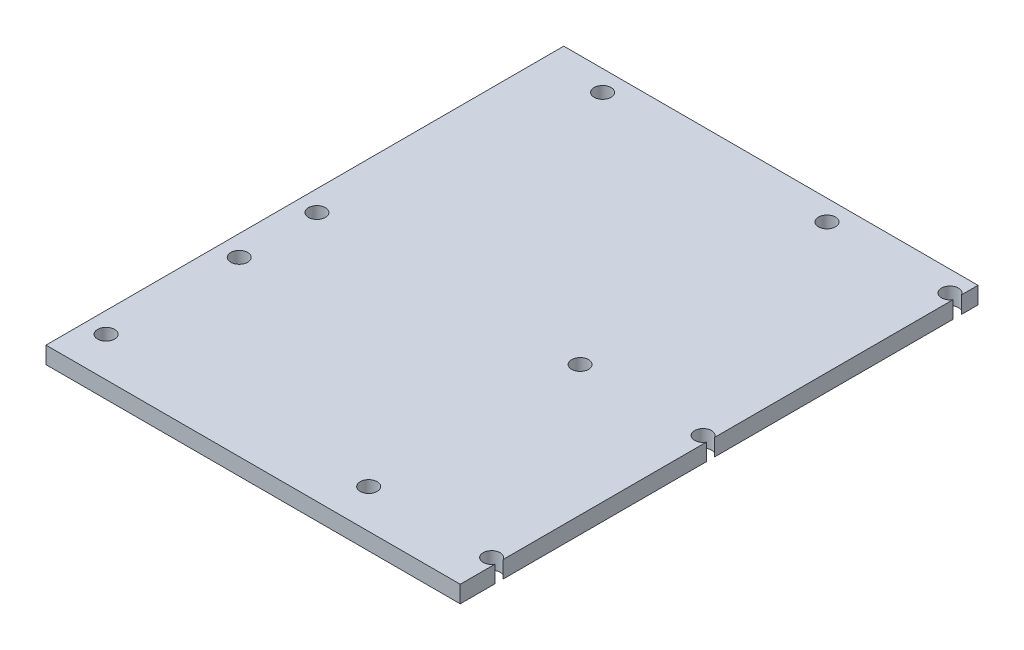
ISO-10303-21;
HEADER;
FILE_DESCRIPTION(('STEP AP214'),'2;1');
FILE_NAME('part.step','',(''),(''),'','','');
FILE_SCHEMA(('AUTOMOTIVE_DESIGN { 1 0 10303 214 1 1 1 1 }'));
ENDSEC;
DATA;
#1=APPLICATION_CONTEXT('core data for automotive mechanical design processes');
#2=APPLICATION_PROTOCOL_DEFINITION('international standard','automotive_design',2000,#1);
#3=PRODUCT_CONTEXT('',#1,'mechanical');
#4=PRODUCT('Part','Part','',(#3));
#5=PRODUCT_RELATED_PRODUCT_CATEGORY('part','',(#4));
#6=PRODUCT_DEFINITION_FORMATION('','',#4);
#7=PRODUCT_DEFINITION_CONTEXT('part definition',#1,'design');
#8=PRODUCT_DEFINITION('design','',#6,#7);
#9=PRODUCT_DEFINITION_SHAPE('','',#8);
#10=(LENGTH_UNIT() NAMED_UNIT(*) SI_UNIT(.MILLI.,.METRE.));
#11=(NAMED_UNIT(*) PLANE_ANGLE_UNIT() SI_UNIT($,.RADIAN.));
#12=(NAMED_UNIT(*) SI_UNIT($,.STERADIAN.) SOLID_ANGLE_UNIT());
#13=UNCERTAINTY_MEASURE_WITH_UNIT(LENGTH_MEASURE(1.E-05),#10,'distance_accuracy_value','');
#14=(GEOMETRIC_REPRESENTATION_CONTEXT(3) GLOBAL_UNCERTAINTY_ASSIGNED_CONTEXT((#13)) GLOBAL_UNIT_ASSIGNED_CONTEXT((#10,
#11,#12)) REPRESENTATION_CONTEXT('',''));
#15=CARTESIAN_POINT('',(0.,0.,0.));
#16=DIRECTION('',(0.,0.,1.));
#17=DIRECTION('',(1.,0.,0.));
#18=AXIS2_PLACEMENT_3D('',#15,#16,#17);
#19=CARTESIAN_POINT('',(0.,10.,0.));
#20=DIRECTION('',(0.,-1.,0.));
#21=DIRECTION('',(0.,0.,-1.));
#22=AXIS2_PLACEMENT_3D('',#19,#20,#21);
#23=PLANE('',#22);
#24=CARTESIAN_POINT('',(45.18,10.,129.54));
#25=DIRECTION('',(0.,-1.,0.));
#26=DIRECTION('',(0.,0.,-1.));
#27=AXIS2_PLACEMENT_3D('',#24,#25,#26);
#28=CIRCLE('',#27,5.);
#29=CARTESIAN_POINT('',(45.18,10.,124.54));
#30=VERTEX_POINT('',#29);
#31=EDGE_CURVE('E241',#30,#30,#28,.T.);
#32=ORIENTED_EDGE('',*,*,#31,.T.);
#33=EDGE_LOOP('',(#32));
#34=FACE_BOUND('',#33,.T.);
#35=CARTESIAN_POINT('',(-109.76,10.,50.8));
#36=DIRECTION('',(0.,-1.,0.));
#37=DIRECTION('',(0.,0.,-1.));
#38=AXIS2_PLACEMENT_3D('',#35,#36,#37);
#39=CIRCLE('',#38,5.00000000000001);
#40=CARTESIAN_POINT('',(-109.76,10.,45.8));
#41=VERTEX_POINT('',#40);
#42=EDGE_CURVE('E229',#41,#41,#39,.T.);
#43=ORIENTED_EDGE('',*,*,#42,.T.);
#44=EDGE_LOOP('',(#43));
#45=FACE_BOUND('',#44,.T.);
#46=CARTESIAN_POINT('',(45.18,10.,5.08));
#47=DIRECTION('',(0.,-1.,0.));
#48=DIRECTION('',(0.,0.,-1.));
#49=AXIS2_PLACEMENT_3D('',#46,#47,#48);
#50=CIRCLE('',#49,5.);
#51=CARTESIAN_POINT('',(45.18,10.,0.0800000000000037));
#52=VERTEX_POINT('',#51);
#53=EDGE_CURVE('E217',#52,#52,#50,.T.);
#54=ORIENTED_EDGE('',*,*,#53,.T.);
#55=EDGE_LOOP('',(#54));
#56=FACE_BOUND('',#55,.T.);
#57=CARTESIAN_POINT('',(-86.9,10.,-140.24));
#58=DIRECTION('',(0.,-1.,0.));
#59=DIRECTION('',(0.,0.,-1.));
#60=AXIS2_PLACEMENT_3D('',#57,#58,#59);
#61=CIRCLE('',#60,5.00000000000001);
#62=CARTESIAN_POINT('',(-86.9,10.,-145.24));
#63=VERTEX_POINT('',#62);
#64=EDGE_CURVE('E128',#63,#63,#61,.T.);
#65=ORIENTED_EDGE('',*,*,#64,.T.);
#66=EDGE_LOOP('',(#65));
#67=FACE_BOUND('',#66,.T.);
#68=CARTESIAN_POINT('',(45.18,10.,-140.24));
#69=DIRECTION('',(0.,-1.,0.));
#70=DIRECTION('',(0.,0.,-1.));
#71=AXIS2_PLACEMENT_3D('',#68,#69,#70);
#72=CIRCLE('',#71,5.);
#73=CARTESIAN_POINT('',(45.18,10.,-145.24));
#74=VERTEX_POINT('',#73);
#75=EDGE_CURVE('E199',#74,#74,#72,.T.);
#76=ORIENTED_EDGE('',*,*,#75,.T.);
#77=EDGE_LOOP('',(#76));
#78=FACE_BOUND('',#77,.T.);
#79=CARTESIAN_POINT('',(-109.76,10.,5.07999999999999));
#80=DIRECTION('',(0.,-1.,0.));
#81=DIRECTION('',(0.,0.,-1.));
#82=AXIS2_PLACEMENT_3D('',#79,#80,#81);
#83=CIRCLE('',#82,5.);
#84=CARTESIAN_POINT('',(-109.76,10.,0.0799999999999829));
#85=VERTEX_POINT('',#84);
#86=EDGE_CURVE('E223',#85,#85,#83,.T.);
#87=ORIENTED_EDGE('',*,*,#86,.T.);
#88=EDGE_LOOP('',(#87));
#89=FACE_BOUND('',#88,.T.);
#90=CARTESIAN_POINT('',(-109.76,10.,129.196094703209));
#91=DIRECTION('',(0.,-1.,0.));
#92=DIRECTION('',(0.,0.,-1.));
#93=AXIS2_PLACEMENT_3D('',#90,#91,#92);
#94=CIRCLE('',#93,5.00000000000001);
#95=CARTESIAN_POINT('',(-109.76,10.,124.196094703209));
#96=VERTEX_POINT('',#95);
#97=EDGE_CURVE('E235',#96,#96,#94,.T.);
#98=ORIENTED_EDGE('',*,*,#97,.T.);
#99=EDGE_LOOP('',(#98));
#100=FACE_BOUND('',#99,.T.);
#101=CARTESIAN_POINT('',(117.57,10.,129.54));
#102=DIRECTION('',(0.,-1.,0.));
#103=DIRECTION('',(0.,0.,-1.));
#104=AXIS2_PLACEMENT_3D('',#101,#102,#103);
#105=CIRCLE('',#104,5.00000000000001);
#106=CARTESIAN_POINT('',(121.92,10.,132.005258607124));
#107=VERTEX_POINT('',#106);
#108=CARTESIAN_POINT('',(121.92,10.,127.074741392876));
#109=VERTEX_POINT('',#108);
#110=EDGE_CURVE('E47',#107,#109,#105,.T.);
#111=ORIENTED_EDGE('',*,*,#110,.T.);
#112=DIRECTION('',(0.,0.,-1.));
#113=VECTOR('',#112,1.);
#114=CARTESIAN_POINT('',(121.92,10.,152.4));
#115=LINE('',#114,#113);
#116=CARTESIAN_POINT('',(121.92,10.,7.54525860712424));
#117=VERTEX_POINT('',#116);
#118=EDGE_CURVE('E54',#109,#117,#115,.T.);
#119=ORIENTED_EDGE('',*,*,#118,.T.);
#120=CARTESIAN_POINT('',(117.57,10.,5.07999999999999));
#121=DIRECTION('',(0.,-1.,0.));
#122=DIRECTION('',(0.,0.,-1.));
#123=AXIS2_PLACEMENT_3D('',#120,#121,#122);
#124=CIRCLE('',#123,5.);
#125=CARTESIAN_POINT('',(121.92,10.,2.61474139287573));
#126=VERTEX_POINT('',#125);
#127=EDGE_CURVE('E213',#117,#126,#124,.T.);
#128=ORIENTED_EDGE('',*,*,#127,.T.);
#129=CARTESIAN_POINT('',(121.92,10.,-137.774741392876));
#130=VERTEX_POINT('',#129);
#131=EDGE_CURVE('E122',#126,#130,#115,.T.);
#132=ORIENTED_EDGE('',*,*,#131,.T.);
#133=CARTESIAN_POINT('',(117.57,10.,-140.24));
#134=DIRECTION('',(0.,-1.,0.));
#135=DIRECTION('',(0.,0.,-1.));
#136=AXIS2_PLACEMENT_3D('',#133,#134,#135);
#137=CIRCLE('',#136,5.00000000000001);
#138=CARTESIAN_POINT('',(121.92,10.,-142.705258607124));
#139=VERTEX_POINT('',#138);
#140=EDGE_CURVE('E208',#130,#139,#137,.T.);
#141=ORIENTED_EDGE('',*,*,#140,.T.);
#142=CARTESIAN_POINT('',(121.92,10.,-152.4));
#143=VERTEX_POINT('',#142);
#144=EDGE_CURVE('E125',#139,#143,#115,.T.);
#145=ORIENTED_EDGE('',*,*,#144,.T.);
#146=DIRECTION('',(-1.,0.,0.));
#147=VECTOR('',#146,1.);
#148=CARTESIAN_POINT('',(-121.92,10.,-152.4));
#149=LINE('',#148,#147);
#150=CARTESIAN_POINT('',(-121.92,10.,-152.4));
#151=VERTEX_POINT('',#150);
#152=EDGE_CURVE('E124',#143,#151,#149,.T.);
#153=ORIENTED_EDGE('',*,*,#152,.T.);
#154=DIRECTION('',(0.,0.,1.));
#155=VECTOR('',#154,1.);
#156=CARTESIAN_POINT('',(-121.92,10.,152.4));
#157=LINE('',#156,#155);
#158=CARTESIAN_POINT('',(-121.92,10.,152.4));
#159=VERTEX_POINT('',#158);
#160=EDGE_CURVE('E131',#151,#159,#157,.T.);
#161=ORIENTED_EDGE('',*,*,#160,.T.);
#162=DIRECTION('',(1.,0.,0.));
#163=VECTOR('',#162,1.);
#164=CARTESIAN_POINT('',(-121.92,10.,152.4));
#165=LINE('',#164,#163);
#166=CARTESIAN_POINT('',(121.92,10.,152.4));
#167=VERTEX_POINT('',#166);
#168=EDGE_CURVE('E133',#159,#167,#165,.T.);
#169=ORIENTED_EDGE('',*,*,#168,.T.);
#170=EDGE_CURVE('E115',#167,#107,#115,.T.);
#171=ORIENTED_EDGE('',*,*,#170,.T.);
#172=EDGE_LOOP('',(#111,#119,#128,#132,#141,#145,#153,#161,#169,#171));
#173=FACE_BOUND('',#172,.T.);
#174=ADVANCED_FACE('F33',(#34,#45,#56,#67,#78,#89,#100,#173),#23,.F.);
#175=CARTESIAN_POINT('',(0.,0.,0.));
#176=DIRECTION('',(0.,-1.,0.));
#177=DIRECTION('',(0.,0.,-1.));
#178=AXIS2_PLACEMENT_3D('',#175,#176,#177);
#179=PLANE('',#178);
#180=CARTESIAN_POINT('',(45.18,0.,129.54));
#181=DIRECTION('',(0.,1.,0.));
#182=DIRECTION('',(0.,0.,1.));
#183=AXIS2_PLACEMENT_3D('',#180,#181,#182);
#184=CIRCLE('',#183,5.);
#185=CARTESIAN_POINT('',(45.18,0.,134.54));
#186=VERTEX_POINT('',#185);
#187=EDGE_CURVE('E116',#186,#186,#184,.T.);
#188=ORIENTED_EDGE('',*,*,#187,.T.);
#189=EDGE_LOOP('',(#188));
#190=FACE_BOUND('',#189,.T.);
#191=CARTESIAN_POINT('',(-109.76,0.,50.8));
#192=DIRECTION('',(0.,1.,0.));
#193=DIRECTION('',(0.,0.,1.));
#194=AXIS2_PLACEMENT_3D('',#191,#192,#193);
#195=CIRCLE('',#194,5.00000000000001);
#196=CARTESIAN_POINT('',(-109.76,0.,55.8));
#197=VERTEX_POINT('',#196);
#198=EDGE_CURVE('E232',#197,#197,#195,.T.);
#199=ORIENTED_EDGE('',*,*,#198,.T.);
#200=EDGE_LOOP('',(#199));
#201=FACE_BOUND('',#200,.T.);
#202=CARTESIAN_POINT('',(45.18,0.,5.08));
#203=DIRECTION('',(0.,1.,0.));
#204=DIRECTION('',(0.,0.,1.));
#205=AXIS2_PLACEMENT_3D('',#202,#203,#204);
#206=CIRCLE('',#205,5.);
#207=CARTESIAN_POINT('',(45.18,0.,10.08));
#208=VERTEX_POINT('',#207);
#209=EDGE_CURVE('E220',#208,#208,#206,.T.);
#210=ORIENTED_EDGE('',*,*,#209,.T.);
#211=EDGE_LOOP('',(#210));
#212=FACE_BOUND('',#211,.T.);
#213=CARTESIAN_POINT('',(-86.9,0.,-140.24));
#214=DIRECTION('',(0.,1.,0.));
#215=DIRECTION('',(0.,0.,1.));
#216=AXIS2_PLACEMENT_3D('',#213,#214,#215);
#217=CIRCLE('',#216,5.00000000000001);
#218=CARTESIAN_POINT('',(-86.9,0.,-135.24));
#219=VERTEX_POINT('',#218);
#220=EDGE_CURVE('E195',#219,#219,#217,.T.);
#221=ORIENTED_EDGE('',*,*,#220,.T.);
#222=EDGE_LOOP('',(#221));
#223=FACE_BOUND('',#222,.T.);
#224=CARTESIAN_POINT('',(45.18,0.,-140.24));
#225=DIRECTION('',(0.,1.,0.));
#226=DIRECTION('',(0.,0.,1.));
#227=AXIS2_PLACEMENT_3D('',#224,#225,#226);
#228=CIRCLE('',#227,5.);
#229=CARTESIAN_POINT('',(45.18,0.,-135.24));
#230=VERTEX_POINT('',#229);
#231=EDGE_CURVE('E203',#230,#230,#228,.T.);
#232=ORIENTED_EDGE('',*,*,#231,.T.);
#233=EDGE_LOOP('',(#232));
#234=FACE_BOUND('',#233,.T.);
#235=CARTESIAN_POINT('',(-109.76,0.,5.07999999999999));
#236=DIRECTION('',(0.,1.,0.));
#237=DIRECTION('',(0.,0.,1.));
#238=AXIS2_PLACEMENT_3D('',#235,#236,#237);
#239=CIRCLE('',#238,5.);
#240=CARTESIAN_POINT('',(-109.76,0.,10.08));
#241=VERTEX_POINT('',#240);
#242=EDGE_CURVE('E226',#241,#241,#239,.T.);
#243=ORIENTED_EDGE('',*,*,#242,.T.);
#244=EDGE_LOOP('',(#243));
#245=FACE_BOUND('',#244,.T.);
#246=CARTESIAN_POINT('',(-109.76,0.,129.196094703209));
#247=DIRECTION('',(0.,1.,0.));
#248=DIRECTION('',(0.,0.,1.));
#249=AXIS2_PLACEMENT_3D('',#246,#247,#248);
#250=CIRCLE('',#249,5.00000000000001);
#251=CARTESIAN_POINT('',(-109.76,0.,134.196094703209));
#252=VERTEX_POINT('',#251);
#253=EDGE_CURVE('E238',#252,#252,#250,.T.);
#254=ORIENTED_EDGE('',*,*,#253,.T.);
#255=EDGE_LOOP('',(#254));
#256=FACE_BOUND('',#255,.T.);
#257=DIRECTION('',(0.,0.,-1.));
#258=VECTOR('',#257,1.);
#259=CARTESIAN_POINT('',(121.92,0.,152.4));
#260=LINE('',#259,#258);
#261=CARTESIAN_POINT('',(121.92,0.,127.074741392876));
#262=VERTEX_POINT('',#261);
#263=CARTESIAN_POINT('',(121.92,0.,7.54525860712424));
#264=VERTEX_POINT('',#263);
#265=EDGE_CURVE('E140',#262,#264,#260,.T.);
#266=ORIENTED_EDGE('',*,*,#265,.F.);
#267=CARTESIAN_POINT('',(117.57,0.,129.54));
#268=DIRECTION('',(0.,1.,0.));
#269=DIRECTION('',(0.,0.,1.));
#270=AXIS2_PLACEMENT_3D('',#267,#268,#269);
#271=CIRCLE('',#270,5.00000000000001);
#272=CARTESIAN_POINT('',(121.92,0.,132.005258607124));
#273=VERTEX_POINT('',#272);
#274=EDGE_CURVE('E110',#262,#273,#271,.T.);
#275=ORIENTED_EDGE('',*,*,#274,.T.);
#276=CARTESIAN_POINT('',(121.92,0.,152.4));
#277=VERTEX_POINT('',#276);
#278=EDGE_CURVE('E136',#277,#273,#260,.T.);
#279=ORIENTED_EDGE('',*,*,#278,.F.);
#280=DIRECTION('',(1.,0.,0.));
#281=VECTOR('',#280,1.);
#282=CARTESIAN_POINT('',(-121.92,0.,152.4));
#283=LINE('',#282,#281);
#284=CARTESIAN_POINT('',(-121.92,0.,152.4));
#285=VERTEX_POINT('',#284);
#286=EDGE_CURVE('E145',#285,#277,#283,.T.);
#287=ORIENTED_EDGE('',*,*,#286,.F.);
#288=DIRECTION('',(0.,0.,1.));
#289=VECTOR('',#288,1.);
#290=CARTESIAN_POINT('',(-121.92,0.,152.4));
#291=LINE('',#290,#289);
#292=CARTESIAN_POINT('',(-121.92,0.,-152.4));
#293=VERTEX_POINT('',#292);
#294=EDGE_CURVE('E143',#293,#285,#291,.T.);
#295=ORIENTED_EDGE('',*,*,#294,.F.);
#296=DIRECTION('',(-1.,0.,0.));
#297=VECTOR('',#296,1.);
#298=CARTESIAN_POINT('',(-121.92,0.,-152.4));
#299=LINE('',#298,#297);
#300=CARTESIAN_POINT('',(121.92,0.,-152.4));
#301=VERTEX_POINT('',#300);
#302=EDGE_CURVE('E139',#301,#293,#299,.T.);
#303=ORIENTED_EDGE('',*,*,#302,.F.);
#304=CARTESIAN_POINT('',(121.92,0.,-142.705258607124));
#305=VERTEX_POINT('',#304);
#306=EDGE_CURVE('E141',#305,#301,#260,.T.);
#307=ORIENTED_EDGE('',*,*,#306,.F.);
#308=CARTESIAN_POINT('',(117.57,0.,-140.24));
#309=DIRECTION('',(0.,1.,0.));
#310=DIRECTION('',(0.,0.,1.));
#311=AXIS2_PLACEMENT_3D('',#308,#309,#310);
#312=CIRCLE('',#311,5.00000000000001);
#313=CARTESIAN_POINT('',(121.92,0.,-137.774741392876));
#314=VERTEX_POINT('',#313);
#315=EDGE_CURVE('E211',#305,#314,#312,.T.);
#316=ORIENTED_EDGE('',*,*,#315,.T.);
#317=CARTESIAN_POINT('',(121.92,0.,2.61474139287573));
#318=VERTEX_POINT('',#317);
#319=EDGE_CURVE('E193',#318,#314,#260,.T.);
#320=ORIENTED_EDGE('',*,*,#319,.F.);
#321=CARTESIAN_POINT('',(117.57,0.,5.07999999999999));
#322=DIRECTION('',(0.,1.,0.));
#323=DIRECTION('',(0.,0.,1.));
#324=AXIS2_PLACEMENT_3D('',#321,#322,#323);
#325=CIRCLE('',#324,5.);
#326=EDGE_CURVE('E215',#318,#264,#325,.T.);
#327=ORIENTED_EDGE('',*,*,#326,.T.);
#328=EDGE_LOOP('',(#266,#275,#279,#287,#295,#303,#307,#316,#320,#327));
#329=FACE_BOUND('',#328,.T.);
#330=ADVANCED_FACE('F168',(#190,#201,#212,#223,#234,#245,#256,#329),#179,.T.);
#331=CARTESIAN_POINT('',(121.92,10.,152.4));
#332=DIRECTION('',(-1.,0.,0.));
#333=DIRECTION('',(0.,0.,1.));
#334=AXIS2_PLACEMENT_3D('',#331,#332,#333);
#335=PLANE('',#334);
#336=DIRECTION('',(0.,-1.,0.));
#337=VECTOR('',#336,1.);
#338=CARTESIAN_POINT('',(121.92,24.142135623731,127.074741392876));
#339=LINE('',#338,#337);
#340=EDGE_CURVE('E11',#262,#109,#339,.F.);
#341=ORIENTED_EDGE('',*,*,#340,.F.);
#342=ORIENTED_EDGE('',*,*,#265,.T.);
#343=DIRECTION('',(0.,-1.,0.));
#344=VECTOR('',#343,1.);
#345=CARTESIAN_POINT('',(121.92,24.142135623731,7.54525860712424));
#346=LINE('',#345,#344);
#347=EDGE_CURVE('E121',#117,#264,#346,.T.);
#348=ORIENTED_EDGE('',*,*,#347,.F.);
#349=ORIENTED_EDGE('',*,*,#118,.F.);
#350=EDGE_LOOP('',(#341,#342,#348,#349));
#351=FACE_BOUND('',#350,.T.);
#352=ADVANCED_FACE('F119',(#351),#335,.F.);
#353=DIRECTION('',(0.,-1.,0.));
#354=VECTOR('',#353,1.);
#355=CARTESIAN_POINT('',(121.92,24.142135623731,132.005258607124));
#356=LINE('',#355,#354);
#357=EDGE_CURVE('E41',#107,#273,#356,.T.);
#358=ORIENTED_EDGE('',*,*,#357,.F.);
#359=ORIENTED_EDGE('',*,*,#170,.F.);
#360=DIRECTION('',(0.,-1.,0.));
#361=VECTOR('',#360,1.);
#362=CARTESIAN_POINT('',(121.92,10.,152.4));
#363=LINE('',#362,#361);
#364=EDGE_CURVE('E135',#167,#277,#363,.T.);
#365=ORIENTED_EDGE('',*,*,#364,.T.);
#366=ORIENTED_EDGE('',*,*,#278,.T.);
#367=EDGE_LOOP('',(#358,#359,#365,#366));
#368=FACE_BOUND('',#367,.T.);
#369=ADVANCED_FACE('F172',(#368),#335,.F.);
#370=DIRECTION('',(0.,-1.,0.));
#371=VECTOR('',#370,1.);
#372=CARTESIAN_POINT('',(121.92,24.142135623731,2.61474139287573));
#373=LINE('',#372,#371);
#374=EDGE_CURVE('E164',#318,#126,#373,.F.);
#375=ORIENTED_EDGE('',*,*,#374,.F.);
#376=ORIENTED_EDGE('',*,*,#319,.T.);
#377=DIRECTION('',(0.,-1.,0.));
#378=VECTOR('',#377,1.);
#379=CARTESIAN_POINT('',(121.92,24.142135623731,-137.774741392876));
#380=LINE('',#379,#378);
#381=EDGE_CURVE('E158',#130,#314,#380,.T.);
#382=ORIENTED_EDGE('',*,*,#381,.F.);
#383=ORIENTED_EDGE('',*,*,#131,.F.);
#384=EDGE_LOOP('',(#375,#376,#382,#383));
#385=FACE_BOUND('',#384,.T.);
#386=ADVANCED_FACE('F282',(#385),#335,.F.);
#387=DIRECTION('',(0.,-1.,0.));
#388=VECTOR('',#387,1.);
#389=CARTESIAN_POINT('',(121.92,24.142135623731,-142.705258607124));
#390=LINE('',#389,#388);
#391=EDGE_CURVE('E161',#305,#139,#390,.F.);
#392=ORIENTED_EDGE('',*,*,#391,.F.);
#393=ORIENTED_EDGE('',*,*,#306,.T.);
#394=DIRECTION('',(0.,-1.,0.));
#395=VECTOR('',#394,1.);
#396=CARTESIAN_POINT('',(121.92,10.,-152.4));
#397=LINE('',#396,#395);
#398=EDGE_CURVE('E155',#143,#301,#397,.T.);
#399=ORIENTED_EDGE('',*,*,#398,.F.);
#400=ORIENTED_EDGE('',*,*,#144,.F.);
#401=EDGE_LOOP('',(#392,#393,#399,#400));
#402=FACE_BOUND('',#401,.T.);
#403=ADVANCED_FACE('F35',(#402),#335,.F.);
#404=CARTESIAN_POINT('',(-121.92,10.,-152.4));
#405=DIRECTION('',(0.,0.,1.));
#406=DIRECTION('',(1.,0.,0.));
#407=AXIS2_PLACEMENT_3D('',#404,#405,#406);
#408=PLANE('',#407);
#409=ORIENTED_EDGE('',*,*,#302,.T.);
#410=DIRECTION('',(0.,-1.,0.));
#411=VECTOR('',#410,1.);
#412=CARTESIAN_POINT('',(-121.92,10.,-152.4));
#413=LINE('',#412,#411);
#414=EDGE_CURVE('E152',#151,#293,#413,.T.);
#415=ORIENTED_EDGE('',*,*,#414,.F.);
#416=ORIENTED_EDGE('',*,*,#152,.F.);
#417=ORIENTED_EDGE('',*,*,#398,.T.);
#418=EDGE_LOOP('',(#409,#415,#416,#417));
#419=FACE_BOUND('',#418,.T.);
#420=ADVANCED_FACE('F187',(#419),#408,.F.);
#421=CARTESIAN_POINT('',(-121.92,10.,152.4));
#422=DIRECTION('',(1.,0.,0.));
#423=DIRECTION('',(0.,0.,-1.));
#424=AXIS2_PLACEMENT_3D('',#421,#422,#423);
#425=PLANE('',#424);
#426=ORIENTED_EDGE('',*,*,#294,.T.);
#427=DIRECTION('',(0.,-1.,0.));
#428=VECTOR('',#427,1.);
#429=CARTESIAN_POINT('',(-121.92,10.,152.4));
#430=LINE('',#429,#428);
#431=EDGE_CURVE('E149',#159,#285,#430,.T.);
#432=ORIENTED_EDGE('',*,*,#431,.F.);
#433=ORIENTED_EDGE('',*,*,#160,.F.);
#434=ORIENTED_EDGE('',*,*,#414,.T.);
#435=EDGE_LOOP('',(#426,#432,#433,#434));
#436=FACE_BOUND('',#435,.T.);
#437=ADVANCED_FACE('F182',(#436),#425,.F.);
#438=CARTESIAN_POINT('',(-121.92,10.,152.4));
#439=DIRECTION('',(0.,0.,-1.));
#440=DIRECTION('',(-1.,0.,0.));
#441=AXIS2_PLACEMENT_3D('',#438,#439,#440);
#442=PLANE('',#441);
#443=ORIENTED_EDGE('',*,*,#286,.T.);
#444=ORIENTED_EDGE('',*,*,#364,.F.);
#445=ORIENTED_EDGE('',*,*,#168,.F.);
#446=ORIENTED_EDGE('',*,*,#431,.T.);
#447=EDGE_LOOP('',(#443,#444,#445,#446));
#448=FACE_BOUND('',#447,.T.);
#449=ADVANCED_FACE('F176',(#448),#442,.F.);
#450=CARTESIAN_POINT('',(-86.9,24.142135623731,-140.24));
#451=DIRECTION('',(0.,-1.,0.));
#452=DIRECTION('',(0.,0.,-1.));
#453=AXIS2_PLACEMENT_3D('',#450,#451,#452);
#454=CYLINDRICAL_SURFACE('',#453,5.00000000000001);
#455=ORIENTED_EDGE('',*,*,#64,.F.);
#456=EDGE_LOOP('',(#455));
#457=FACE_BOUND('',#456,.T.);
#458=ORIENTED_EDGE('',*,*,#220,.F.);
#459=EDGE_LOOP('',(#458));
#460=FACE_BOUND('',#459,.T.);
#461=ADVANCED_FACE('F272',(#457,#460),#454,.F.);
#462=CARTESIAN_POINT('',(45.18,24.142135623731,-140.24));
#463=DIRECTION('',(0.,-1.,0.));
#464=DIRECTION('',(0.,0.,-1.));
#465=AXIS2_PLACEMENT_3D('',#462,#463,#464);
#466=CYLINDRICAL_SURFACE('',#465,5.);
#467=ORIENTED_EDGE('',*,*,#75,.F.);
#468=EDGE_LOOP('',(#467));
#469=FACE_BOUND('',#468,.T.);
#470=ORIENTED_EDGE('',*,*,#231,.F.);
#471=EDGE_LOOP('',(#470));
#472=FACE_BOUND('',#471,.T.);
#473=ADVANCED_FACE('F311',(#469,#472),#466,.F.);
#474=CARTESIAN_POINT('',(117.57,24.142135623731,-140.24));
#475=DIRECTION('',(0.,-1.,0.));
#476=DIRECTION('',(0.,0.,-1.));
#477=AXIS2_PLACEMENT_3D('',#474,#475,#476);
#478=CYLINDRICAL_SURFACE('',#477,5.00000000000001);
#479=ORIENTED_EDGE('',*,*,#391,.T.);
#480=ORIENTED_EDGE('',*,*,#140,.F.);
#481=ORIENTED_EDGE('',*,*,#381,.T.);
#482=ORIENTED_EDGE('',*,*,#315,.F.);
#483=EDGE_LOOP('',(#479,#480,#481,#482));
#484=FACE_BOUND('',#483,.T.);
#485=ADVANCED_FACE('F321',(#484),#478,.F.);
#486=CARTESIAN_POINT('',(117.57,24.142135623731,5.07999999999999));
#487=DIRECTION('',(0.,-1.,0.));
#488=DIRECTION('',(0.,0.,-1.));
#489=AXIS2_PLACEMENT_3D('',#486,#487,#488);
#490=CYLINDRICAL_SURFACE('',#489,5.);
#491=ORIENTED_EDGE('',*,*,#374,.T.);
#492=ORIENTED_EDGE('',*,*,#127,.F.);
#493=ORIENTED_EDGE('',*,*,#347,.T.);
#494=ORIENTED_EDGE('',*,*,#326,.F.);
#495=EDGE_LOOP('',(#491,#492,#493,#494));
#496=FACE_BOUND('',#495,.T.);
#497=ADVANCED_FACE('F330',(#496),#490,.F.);
#498=CARTESIAN_POINT('',(45.18,24.142135623731,5.08));
#499=DIRECTION('',(0.,-1.,0.));
#500=DIRECTION('',(0.,0.,-1.));
#501=AXIS2_PLACEMENT_3D('',#498,#499,#500);
#502=CYLINDRICAL_SURFACE('',#501,5.);
#503=ORIENTED_EDGE('',*,*,#53,.F.);
#504=EDGE_LOOP('',(#503));
#505=FACE_BOUND('',#504,.T.);
#506=ORIENTED_EDGE('',*,*,#209,.F.);
#507=EDGE_LOOP('',(#506));
#508=FACE_BOUND('',#507,.T.);
#509=ADVANCED_FACE('F340',(#505,#508),#502,.F.);
#510=CARTESIAN_POINT('',(-109.76,24.142135623731,5.07999999999999));
#511=DIRECTION('',(0.,-1.,0.));
#512=DIRECTION('',(0.,0.,-1.));
#513=AXIS2_PLACEMENT_3D('',#510,#511,#512);
#514=CYLINDRICAL_SURFACE('',#513,5.);
#515=ORIENTED_EDGE('',*,*,#86,.F.);
#516=EDGE_LOOP('',(#515));
#517=FACE_BOUND('',#516,.T.);
#518=ORIENTED_EDGE('',*,*,#242,.F.);
#519=EDGE_LOOP('',(#518));
#520=FACE_BOUND('',#519,.T.);
#521=ADVANCED_FACE('F350',(#517,#520),#514,.F.);
#522=CARTESIAN_POINT('',(-109.76,24.142135623731,50.8));
#523=DIRECTION('',(0.,-1.,0.));
#524=DIRECTION('',(0.,0.,-1.));
#525=AXIS2_PLACEMENT_3D('',#522,#523,#524);
#526=CYLINDRICAL_SURFACE('',#525,5.00000000000001);
#527=ORIENTED_EDGE('',*,*,#42,.F.);
#528=EDGE_LOOP('',(#527));
#529=FACE_BOUND('',#528,.T.);
#530=ORIENTED_EDGE('',*,*,#198,.F.);
#531=EDGE_LOOP('',(#530));
#532=FACE_BOUND('',#531,.T.);
#533=ADVANCED_FACE('F259',(#529,#532),#526,.F.);
#534=CARTESIAN_POINT('',(-109.76,24.142135623731,129.196094703209));
#535=DIRECTION('',(0.,-1.,0.));
#536=DIRECTION('',(0.,0.,-1.));
#537=AXIS2_PLACEMENT_3D('',#534,#535,#536);
#538=CYLINDRICAL_SURFACE('',#537,5.00000000000001);
#539=ORIENTED_EDGE('',*,*,#97,.F.);
#540=EDGE_LOOP('',(#539));
#541=FACE_BOUND('',#540,.T.);
#542=ORIENTED_EDGE('',*,*,#253,.F.);
#543=EDGE_LOOP('',(#542));
#544=FACE_BOUND('',#543,.T.);
#545=ADVANCED_FACE('F251',(#541,#544),#538,.F.);
#546=CARTESIAN_POINT('',(45.18,24.142135623731,129.54));
#547=DIRECTION('',(0.,-1.,0.));
#548=DIRECTION('',(0.,0.,-1.));
#549=AXIS2_PLACEMENT_3D('',#546,#547,#548);
#550=CYLINDRICAL_SURFACE('',#549,5.);
#551=ORIENTED_EDGE('',*,*,#31,.F.);
#552=EDGE_LOOP('',(#551));
#553=FACE_BOUND('',#552,.T.);
#554=ORIENTED_EDGE('',*,*,#187,.F.);
#555=EDGE_LOOP('',(#554));
#556=FACE_BOUND('',#555,.T.);
#557=ADVANCED_FACE('F249',(#553,#556),#550,.F.);
#558=CARTESIAN_POINT('',(117.57,24.142135623731,129.54));
#559=DIRECTION('',(0.,-1.,0.));
#560=DIRECTION('',(0.,0.,-1.));
#561=AXIS2_PLACEMENT_3D('',#558,#559,#560);
#562=CYLINDRICAL_SURFACE('',#561,5.00000000000001);
#563=ORIENTED_EDGE('',*,*,#340,.T.);
#564=ORIENTED_EDGE('',*,*,#110,.F.);
#565=ORIENTED_EDGE('',*,*,#357,.T.);
#566=ORIENTED_EDGE('',*,*,#274,.F.);
#567=EDGE_LOOP('',(#563,#564,#565,#566));
#568=FACE_BOUND('',#567,.T.);
#569=ADVANCED_FACE('F108',(#568),#562,.F.);
#570=CLOSED_SHELL('',(#174,#330,#352,#369,#386,#403,#420,#437,#449,#461,#473,#485,#497,#509,
#521,#533,#545,#557,#569));
#571=MANIFOLD_SOLID_BREP('B2',#570);
#572=ADVANCED_BREP_SHAPE_REPRESENTATION('',(#18,#571),#14);
#573=SHAPE_DEFINITION_REPRESENTATION(#9,#572);
ENDSEC;
END-ISO-10303-21;
